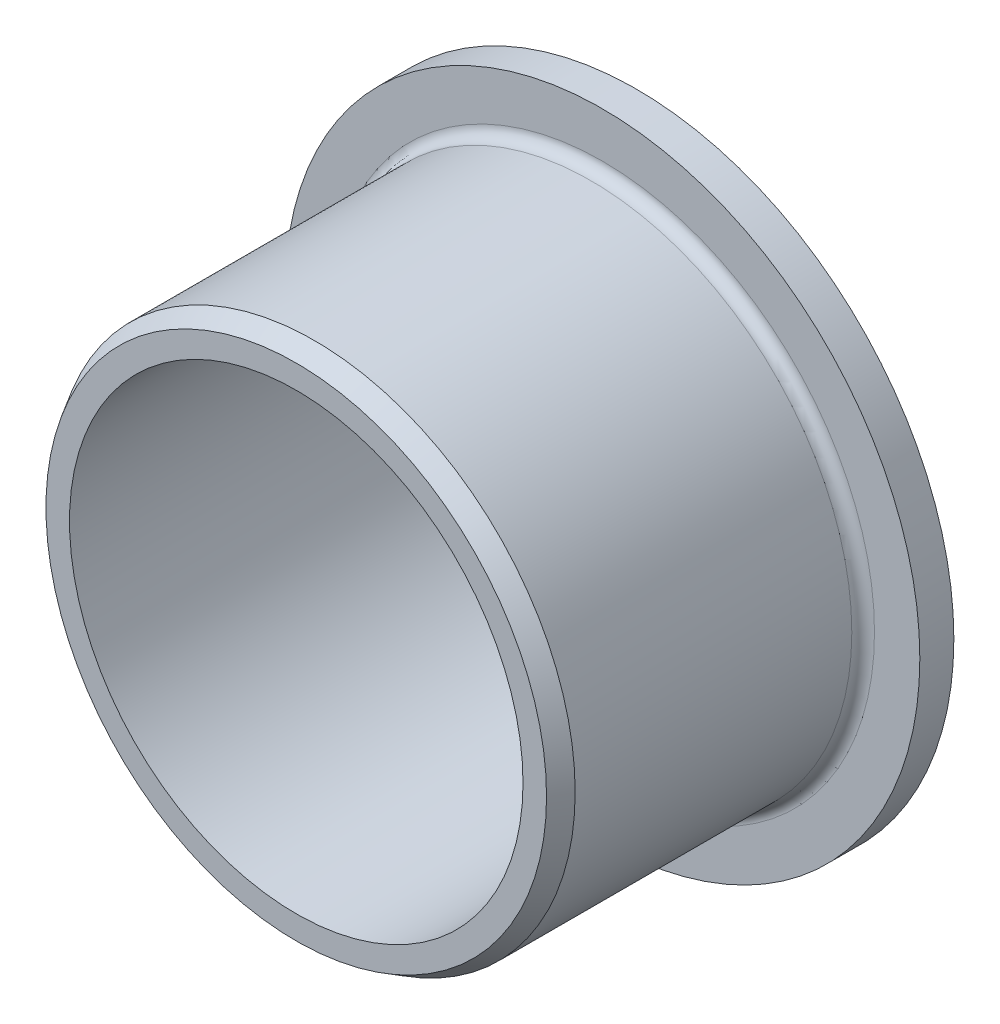
ISO-10303-21;
HEADER;
FILE_DESCRIPTION(('STEP AP214'),'2;1');
FILE_NAME('part.step','',(''),(''),'','','');
FILE_SCHEMA(('AUTOMOTIVE_DESIGN { 1 0 10303 214 1 1 1 1 }'));
ENDSEC;
DATA;
#1=APPLICATION_CONTEXT('core data for automotive mechanical design processes');
#2=APPLICATION_PROTOCOL_DEFINITION('international standard','automotive_design',2000,#1);
#3=PRODUCT_CONTEXT('',#1,'mechanical');
#4=PRODUCT('Part','Part','',(#3));
#5=PRODUCT_RELATED_PRODUCT_CATEGORY('part','',(#4));
#6=PRODUCT_DEFINITION_FORMATION('','',#4);
#7=PRODUCT_DEFINITION_CONTEXT('part definition',#1,'design');
#8=PRODUCT_DEFINITION('design','',#6,#7);
#9=PRODUCT_DEFINITION_SHAPE('','',#8);
#10=(LENGTH_UNIT() NAMED_UNIT(*) SI_UNIT(.MILLI.,.METRE.));
#11=(NAMED_UNIT(*) PLANE_ANGLE_UNIT() SI_UNIT($,.RADIAN.));
#12=(NAMED_UNIT(*) SI_UNIT($,.STERADIAN.) SOLID_ANGLE_UNIT());
#13=UNCERTAINTY_MEASURE_WITH_UNIT(LENGTH_MEASURE(1.E-05),#10,'distance_accuracy_value','');
#14=(GEOMETRIC_REPRESENTATION_CONTEXT(3) GLOBAL_UNCERTAINTY_ASSIGNED_CONTEXT((#13)) GLOBAL_UNIT_ASSIGNED_CONTEXT((#10,
#11,#12)) REPRESENTATION_CONTEXT('',''));
#15=CARTESIAN_POINT('',(0.,0.,0.));
#16=DIRECTION('',(0.,0.,1.));
#17=DIRECTION('',(1.,0.,0.));
#18=AXIS2_PLACEMENT_3D('',#15,#16,#17);
#19=CARTESIAN_POINT('',(0.,0.,1.5));
#20=DIRECTION('',(0.,0.,1.));
#21=DIRECTION('',(1.,0.,0.));
#22=AXIS2_PLACEMENT_3D('',#19,#20,#21);
#23=PLANE('',#22);
#24=CARTESIAN_POINT('',(0.,0.,1.5));
#25=DIRECTION('',(0.,0.,1.));
#26=DIRECTION('',(1.,0.,0.));
#27=AXIS2_PLACEMENT_3D('',#24,#25,#26);
#28=CIRCLE('',#27,12.);
#29=CARTESIAN_POINT('',(12.,0.,1.5));
#30=VERTEX_POINT('',#29);
#31=EDGE_CURVE('E50',#30,#30,#28,.F.);
#32=ORIENTED_EDGE('',*,*,#31,.T.);
#33=EDGE_LOOP('',(#32));
#34=FACE_BOUND('',#33,.T.);
#35=CARTESIAN_POINT('',(0.,0.,1.5));
#36=DIRECTION('',(0.,0.,1.));
#37=DIRECTION('',(1.,0.,0.));
#38=AXIS2_PLACEMENT_3D('',#35,#36,#37);
#39=CIRCLE('',#38,14.);
#40=CARTESIAN_POINT('',(14.,0.,1.5));
#41=VERTEX_POINT('',#40);
#42=EDGE_CURVE('E59',#41,#41,#39,.T.);
#43=ORIENTED_EDGE('',*,*,#42,.T.);
#44=EDGE_LOOP('',(#43));
#45=FACE_BOUND('',#44,.T.);
#46=ADVANCED_FACE('F38',(#34,#45),#23,.T.);
#47=CARTESIAN_POINT('',(0.,0.,0.));
#48=DIRECTION('',(0.,0.,1.));
#49=DIRECTION('',(1.,0.,0.));
#50=AXIS2_PLACEMENT_3D('',#47,#48,#49);
#51=PLANE('',#50);
#52=CARTESIAN_POINT('',(0.,0.,0.));
#53=DIRECTION('',(0.,0.,1.));
#54=DIRECTION('',(1.,0.,0.));
#55=AXIS2_PLACEMENT_3D('',#52,#53,#54);
#56=CIRCLE('',#55,14.);
#57=CARTESIAN_POINT('',(14.,0.,0.));
#58=VERTEX_POINT('',#57);
#59=EDGE_CURVE('E60',#58,#58,#56,.T.);
#60=ORIENTED_EDGE('',*,*,#59,.F.);
#61=EDGE_LOOP('',(#60));
#62=FACE_BOUND('',#61,.T.);
#63=CARTESIAN_POINT('',(0.,0.,0.));
#64=DIRECTION('',(0.,0.,1.));
#65=DIRECTION('',(1.,0.,0.));
#66=AXIS2_PLACEMENT_3D('',#63,#64,#65);
#67=CIRCLE('',#66,10.);
#68=CARTESIAN_POINT('',(10.,0.,0.));
#69=VERTEX_POINT('',#68);
#70=EDGE_CURVE('E66',#69,#69,#67,.T.);
#71=ORIENTED_EDGE('',*,*,#70,.T.);
#72=EDGE_LOOP('',(#71));
#73=FACE_BOUND('',#72,.T.);
#74=ADVANCED_FACE('F85',(#62,#73),#51,.F.);
#75=CARTESIAN_POINT('',(0.,0.,1.5));
#76=DIRECTION('',(0.,0.,-1.));
#77=DIRECTION('',(-1.,0.,0.));
#78=AXIS2_PLACEMENT_3D('',#75,#76,#77);
#79=CYLINDRICAL_SURFACE('',#78,14.);
#80=ORIENTED_EDGE('',*,*,#42,.F.);
#81=EDGE_LOOP('',(#80));
#82=FACE_BOUND('',#81,.T.);
#83=ORIENTED_EDGE('',*,*,#59,.T.);
#84=EDGE_LOOP('',(#83));
#85=FACE_BOUND('',#84,.T.);
#86=ADVANCED_FACE('F78',(#82,#85),#79,.T.);
#87=CARTESIAN_POINT('',(0.,0.,15.));
#88=DIRECTION('',(0.,0.,1.));
#89=DIRECTION('',(1.,0.,0.));
#90=AXIS2_PLACEMENT_3D('',#87,#88,#89);
#91=PLANE('',#90);
#92=CARTESIAN_POINT('',(0.,0.,15.));
#93=DIRECTION('',(0.,0.,1.));
#94=DIRECTION('',(1.,0.,0.));
#95=AXIS2_PLACEMENT_3D('',#92,#93,#94);
#96=CIRCLE('',#95,11.0381197846483);
#97=CARTESIAN_POINT('',(11.0381197846483,0.,15.));
#98=VERTEX_POINT('',#97);
#99=EDGE_CURVE('E46',#98,#98,#96,.T.);
#100=ORIENTED_EDGE('',*,*,#99,.T.);
#101=EDGE_LOOP('',(#100));
#102=FACE_BOUND('',#101,.T.);
#103=CARTESIAN_POINT('',(0.,0.,15.));
#104=DIRECTION('',(0.,0.,1.));
#105=DIRECTION('',(1.,0.,0.));
#106=AXIS2_PLACEMENT_3D('',#103,#104,#105);
#107=CIRCLE('',#106,10.);
#108=CARTESIAN_POINT('',(10.,0.,15.));
#109=VERTEX_POINT('',#108);
#110=EDGE_CURVE('E63',#109,#109,#107,.T.);
#111=ORIENTED_EDGE('',*,*,#110,.F.);
#112=EDGE_LOOP('',(#111));
#113=FACE_BOUND('',#112,.T.);
#114=ADVANCED_FACE('F75',(#102,#113),#91,.T.);
#115=CARTESIAN_POINT('',(0.,0.,15.));
#116=DIRECTION('',(0.,0.,-1.));
#117=DIRECTION('',(-1.,0.,0.));
#118=AXIS2_PLACEMENT_3D('',#115,#116,#117);
#119=CYLINDRICAL_SURFACE('',#118,11.5);
#120=CARTESIAN_POINT('',(0.,0.,14.2));
#121=DIRECTION('',(0.,0.,1.));
#122=DIRECTION('',(1.,0.,0.));
#123=AXIS2_PLACEMENT_3D('',#120,#121,#122);
#124=CIRCLE('',#123,11.5);
#125=CARTESIAN_POINT('',(11.5,0.,14.2));
#126=VERTEX_POINT('',#125);
#127=EDGE_CURVE('E11',#126,#126,#124,.F.);
#128=ORIENTED_EDGE('',*,*,#127,.T.);
#129=EDGE_LOOP('',(#128));
#130=FACE_BOUND('',#129,.T.);
#131=CARTESIAN_POINT('',(0.,0.,2.));
#132=DIRECTION('',(0.,0.,1.));
#133=DIRECTION('',(1.,0.,0.));
#134=AXIS2_PLACEMENT_3D('',#131,#132,#133);
#135=CIRCLE('',#134,11.5);
#136=CARTESIAN_POINT('',(11.5,0.,2.));
#137=VERTEX_POINT('',#136);
#138=EDGE_CURVE('E54',#137,#137,#135,.T.);
#139=ORIENTED_EDGE('',*,*,#138,.T.);
#140=EDGE_LOOP('',(#139));
#141=FACE_BOUND('',#140,.T.);
#142=ADVANCED_FACE('F77',(#130,#141),#119,.T.);
#143=CARTESIAN_POINT('',(0.,0.,15.));
#144=DIRECTION('',(0.,0.,-1.));
#145=DIRECTION('',(-1.,0.,0.));
#146=AXIS2_PLACEMENT_3D('',#143,#144,#145);
#147=CYLINDRICAL_SURFACE('',#146,10.);
#148=ORIENTED_EDGE('',*,*,#110,.T.);
#149=EDGE_LOOP('',(#148));
#150=FACE_BOUND('',#149,.T.);
#151=ORIENTED_EDGE('',*,*,#70,.F.);
#152=EDGE_LOOP('',(#151));
#153=FACE_BOUND('',#152,.T.);
#154=ADVANCED_FACE('F72',(#150,#153),#147,.F.);
#155=CARTESIAN_POINT('',(0.,0.,2.));
#156=DIRECTION('',(0.,0.,1.));
#157=DIRECTION('',(1.,0.,0.));
#158=AXIS2_PLACEMENT_3D('',#155,#156,#157);
#159=TOROIDAL_SURFACE('',#158,12.,0.5);
#160=ORIENTED_EDGE('',*,*,#31,.F.);
#161=EDGE_LOOP('',(#160));
#162=FACE_BOUND('',#161,.T.);
#163=ORIENTED_EDGE('',*,*,#138,.F.);
#164=EDGE_LOOP('',(#163));
#165=FACE_BOUND('',#164,.T.);
#166=ADVANCED_FACE('F98',(#162,#165),#159,.F.);
#167=CARTESIAN_POINT('',(0.,0.,15.));
#168=DIRECTION('',(0.,0.,-1.));
#169=DIRECTION('',(-1.,0.,0.));
#170=AXIS2_PLACEMENT_3D('',#167,#168,#169);
#171=CONICAL_SURFACE('',#170,11.0381197846483,0.523598775598295);
#172=ORIENTED_EDGE('',*,*,#127,.F.);
#173=EDGE_LOOP('',(#172));
#174=FACE_BOUND('',#173,.T.);
#175=ORIENTED_EDGE('',*,*,#99,.F.);
#176=EDGE_LOOP('',(#175));
#177=FACE_BOUND('',#176,.T.);
#178=ADVANCED_FACE('F41',(#174,#177),#171,.T.);
#179=CLOSED_SHELL('',(#46,#74,#86,#114,#142,#154,#166,#178));
#180=MANIFOLD_SOLID_BREP('B2',#179);
#181=ADVANCED_BREP_SHAPE_REPRESENTATION('',(#18,#180),#14);
#182=SHAPE_DEFINITION_REPRESENTATION(#9,#181);
ENDSEC;
END-ISO-10303-21;
